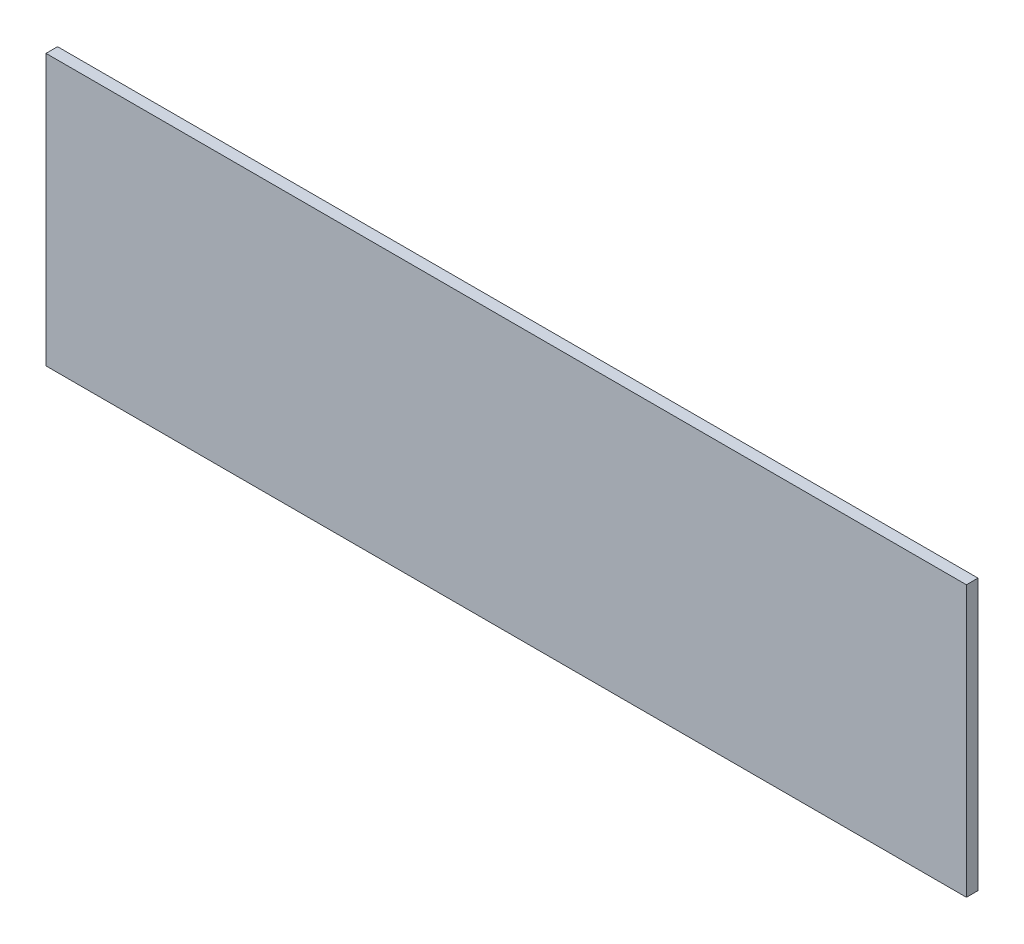
ISO-10303-21;
HEADER;
FILE_DESCRIPTION(('STEP AP214'),'2;1');
FILE_NAME('part.step','',(''),(''),'','','');
FILE_SCHEMA(('AUTOMOTIVE_DESIGN { 1 0 10303 214 1 1 1 1 }'));
ENDSEC;
DATA;
#1=APPLICATION_CONTEXT('core data for automotive mechanical design processes');
#2=APPLICATION_PROTOCOL_DEFINITION('international standard','automotive_design',2000,#1);
#3=PRODUCT_CONTEXT('',#1,'mechanical');
#4=PRODUCT('Part','Part','',(#3));
#5=PRODUCT_RELATED_PRODUCT_CATEGORY('part','',(#4));
#6=PRODUCT_DEFINITION_FORMATION('','',#4);
#7=PRODUCT_DEFINITION_CONTEXT('part definition',#1,'design');
#8=PRODUCT_DEFINITION('design','',#6,#7);
#9=PRODUCT_DEFINITION_SHAPE('','',#8);
#10=(LENGTH_UNIT() NAMED_UNIT(*) SI_UNIT(.MILLI.,.METRE.));
#11=(NAMED_UNIT(*) PLANE_ANGLE_UNIT() SI_UNIT($,.RADIAN.));
#12=(NAMED_UNIT(*) SI_UNIT($,.STERADIAN.) SOLID_ANGLE_UNIT());
#13=UNCERTAINTY_MEASURE_WITH_UNIT(LENGTH_MEASURE(1.E-05),#10,'distance_accuracy_value','');
#14=(GEOMETRIC_REPRESENTATION_CONTEXT(3) GLOBAL_UNCERTAINTY_ASSIGNED_CONTEXT((#13)) GLOBAL_UNIT_ASSIGNED_CONTEXT((#10,
#11,#12)) REPRESENTATION_CONTEXT('',''));
#15=CARTESIAN_POINT('',(0.,0.,0.));
#16=DIRECTION('',(0.,0.,1.));
#17=DIRECTION('',(1.,0.,0.));
#18=AXIS2_PLACEMENT_3D('',#15,#16,#17);
#19=CARTESIAN_POINT('',(-817.302112889997,1.38777878078145E-13,-11.9062500000005));
#20=DIRECTION('',(0.,0.,-1.));
#21=DIRECTION('',(0.,1.,0.));
#22=AXIS2_PLACEMENT_3D('',#19,#20,#21);
#23=PLANE('',#22);
#24=DIRECTION('',(1.,0.,0.));
#25=VECTOR('',#24,1.);
#26=CARTESIAN_POINT('',(-817.302112889997,-687.037955376592,-11.9062500000002));
#27=LINE('',#26,#25);
#28=CARTESIAN_POINT('',(-473.329414511646,-687.037955376592,-11.9062500000002));
#29=VERTEX_POINT('',#28);
#30=CARTESIAN_POINT('',(473.329414511646,-687.037955376592,-11.9062500000002));
#31=VERTEX_POINT('',#30);
#32=EDGE_CURVE('E112',#29,#31,#27,.T.);
#33=ORIENTED_EDGE('',*,*,#32,.F.);
#34=DIRECTION('',(0.,1.,0.));
#35=VECTOR('',#34,1.);
#36=CARTESIAN_POINT('',(-473.329414511646,1.38777878078145E-13,-11.9062500000005));
#37=LINE('',#36,#35);
#38=CARTESIAN_POINT('',(-473.329414511646,-408.634753856054,-11.9062500000005));
#39=VERTEX_POINT('',#38);
#40=EDGE_CURVE('E72',#29,#39,#37,.T.);
#41=ORIENTED_EDGE('',*,*,#40,.T.);
#42=DIRECTION('',(1.,0.,0.));
#43=VECTOR('',#42,1.);
#44=CARTESIAN_POINT('',(-817.302112889997,-408.634753856054,-11.9062500000003));
#45=LINE('',#44,#43);
#46=CARTESIAN_POINT('',(473.329414511646,-408.634753856054,-11.9062500000003));
#47=VERTEX_POINT('',#46);
#48=EDGE_CURVE('E68',#39,#47,#45,.T.);
#49=ORIENTED_EDGE('',*,*,#48,.T.);
#50=DIRECTION('',(0.,1.,0.));
#51=VECTOR('',#50,1.);
#52=CARTESIAN_POINT('',(473.329414511646,1.38777878078145E-13,-11.9062500000005));
#53=LINE('',#52,#51);
#54=EDGE_CURVE('E45',#31,#47,#53,.T.);
#55=ORIENTED_EDGE('',*,*,#54,.F.);
#56=EDGE_LOOP('',(#33,#41,#49,#55));
#57=FACE_BOUND('',#56,.T.);
#58=ADVANCED_FACE('F36',(#57),#23,.T.);
#59=CARTESIAN_POINT('',(0.,0.,0.));
#60=DIRECTION('',(0.,0.,-1.));
#61=DIRECTION('',(-1.,0.,0.));
#62=AXIS2_PLACEMENT_3D('',#59,#60,#61);
#63=PLANE('',#62);
#64=DIRECTION('',(0.,1.,0.));
#65=VECTOR('',#64,1.);
#66=CARTESIAN_POINT('',(473.329414511646,-408.634753856054,0.));
#67=LINE('',#66,#65);
#68=CARTESIAN_POINT('',(473.329414511646,-687.037955376592,0.));
#69=VERTEX_POINT('',#68);
#70=CARTESIAN_POINT('',(473.329414511646,-408.634753856054,0.));
#71=VERTEX_POINT('',#70);
#72=EDGE_CURVE('E97',#69,#71,#67,.T.);
#73=ORIENTED_EDGE('',*,*,#72,.T.);
#74=DIRECTION('',(-1.,0.,0.));
#75=VECTOR('',#74,1.);
#76=CARTESIAN_POINT('',(473.329414511646,-408.634753856054,0.));
#77=LINE('',#76,#75);
#78=CARTESIAN_POINT('',(-473.329414511646,-408.634753856054,0.));
#79=VERTEX_POINT('',#78);
#80=EDGE_CURVE('E85',#71,#79,#77,.T.);
#81=ORIENTED_EDGE('',*,*,#80,.T.);
#82=DIRECTION('',(0.,-1.,0.));
#83=VECTOR('',#82,1.);
#84=CARTESIAN_POINT('',(-473.329414511646,-408.634753856054,0.));
#85=LINE('',#84,#83);
#86=CARTESIAN_POINT('',(-473.329414511646,-687.037955376592,0.));
#87=VERTEX_POINT('',#86);
#88=EDGE_CURVE('E89',#79,#87,#85,.T.);
#89=ORIENTED_EDGE('',*,*,#88,.T.);
#90=DIRECTION('',(1.,0.,0.));
#91=VECTOR('',#90,1.);
#92=CARTESIAN_POINT('',(473.329414511646,-687.037955376592,0.));
#93=LINE('',#92,#91);
#94=EDGE_CURVE('E88',#87,#69,#93,.T.);
#95=ORIENTED_EDGE('',*,*,#94,.T.);
#96=EDGE_LOOP('',(#73,#81,#89,#95));
#97=FACE_BOUND('',#96,.T.);
#98=ADVANCED_FACE('F96',(#97),#63,.F.);
#99=CARTESIAN_POINT('',(473.329414511646,-408.634753856054,-998.654080595353));
#100=DIRECTION('',(0.,1.,0.));
#101=DIRECTION('',(-1.,0.,0.));
#102=AXIS2_PLACEMENT_3D('',#99,#100,#101);
#103=PLANE('',#102);
#104=DIRECTION('',(0.,0.,1.));
#105=VECTOR('',#104,1.);
#106=CARTESIAN_POINT('',(473.329414511646,-408.634753856054,-998.654080595353));
#107=LINE('',#106,#105);
#108=EDGE_CURVE('E11',#47,#71,#107,.T.);
#109=ORIENTED_EDGE('',*,*,#108,.F.);
#110=ORIENTED_EDGE('',*,*,#48,.F.);
#111=DIRECTION('',(0.,0.,1.));
#112=VECTOR('',#111,1.);
#113=CARTESIAN_POINT('',(-473.329414511646,-408.634753856054,-998.654080595353));
#114=LINE('',#113,#112);
#115=EDGE_CURVE('E82',#39,#79,#114,.T.);
#116=ORIENTED_EDGE('',*,*,#115,.T.);
#117=ORIENTED_EDGE('',*,*,#80,.F.);
#118=EDGE_LOOP('',(#109,#110,#116,#117));
#119=FACE_BOUND('',#118,.T.);
#120=ADVANCED_FACE('F83',(#119),#103,.T.);
#121=CARTESIAN_POINT('',(-473.329414511646,-408.634753856054,-998.654080595353));
#122=DIRECTION('',(-1.,0.,0.));
#123=DIRECTION('',(0.,0.,1.));
#124=AXIS2_PLACEMENT_3D('',#121,#122,#123);
#125=PLANE('',#124);
#126=ORIENTED_EDGE('',*,*,#115,.F.);
#127=ORIENTED_EDGE('',*,*,#40,.F.);
#128=DIRECTION('',(0.,0.,1.));
#129=VECTOR('',#128,1.);
#130=CARTESIAN_POINT('',(-473.329414511646,-687.037955376592,-998.654080595353));
#131=LINE('',#130,#129);
#132=EDGE_CURVE('E78',#29,#87,#131,.T.);
#133=ORIENTED_EDGE('',*,*,#132,.T.);
#134=ORIENTED_EDGE('',*,*,#88,.F.);
#135=EDGE_LOOP('',(#126,#127,#133,#134));
#136=FACE_BOUND('',#135,.T.);
#137=ADVANCED_FACE('F90',(#136),#125,.T.);
#138=CARTESIAN_POINT('',(473.329414511646,-687.037955376592,-998.654080595353));
#139=DIRECTION('',(0.,-1.,0.));
#140=DIRECTION('',(1.,0.,0.));
#141=AXIS2_PLACEMENT_3D('',#138,#139,#140);
#142=PLANE('',#141);
#143=ORIENTED_EDGE('',*,*,#132,.F.);
#144=ORIENTED_EDGE('',*,*,#32,.T.);
#145=DIRECTION('',(0.,0.,1.));
#146=VECTOR('',#145,1.);
#147=CARTESIAN_POINT('',(473.329414511646,-687.037955376592,-998.654080595353));
#148=LINE('',#147,#146);
#149=EDGE_CURVE('E107',#31,#69,#148,.T.);
#150=ORIENTED_EDGE('',*,*,#149,.T.);
#151=ORIENTED_EDGE('',*,*,#94,.F.);
#152=EDGE_LOOP('',(#143,#144,#150,#151));
#153=FACE_BOUND('',#152,.T.);
#154=ADVANCED_FACE('F126',(#153),#142,.T.);
#155=CARTESIAN_POINT('',(473.329414511646,-408.634753856054,-998.654080595353));
#156=DIRECTION('',(1.,0.,0.));
#157=DIRECTION('',(0.,0.,-1.));
#158=AXIS2_PLACEMENT_3D('',#155,#156,#157);
#159=PLANE('',#158);
#160=ORIENTED_EDGE('',*,*,#149,.F.);
#161=ORIENTED_EDGE('',*,*,#54,.T.);
#162=ORIENTED_EDGE('',*,*,#108,.T.);
#163=ORIENTED_EDGE('',*,*,#72,.F.);
#164=EDGE_LOOP('',(#160,#161,#162,#163));
#165=FACE_BOUND('',#164,.T.);
#166=ADVANCED_FACE('F128',(#165),#159,.T.);
#167=CLOSED_SHELL('',(#58,#98,#120,#137,#154,#166));
#168=MANIFOLD_SOLID_BREP('B2',#167);
#169=ADVANCED_BREP_SHAPE_REPRESENTATION('',(#18,#168),#14);
#170=SHAPE_DEFINITION_REPRESENTATION(#9,#169);
ENDSEC;
END-ISO-10303-21;
